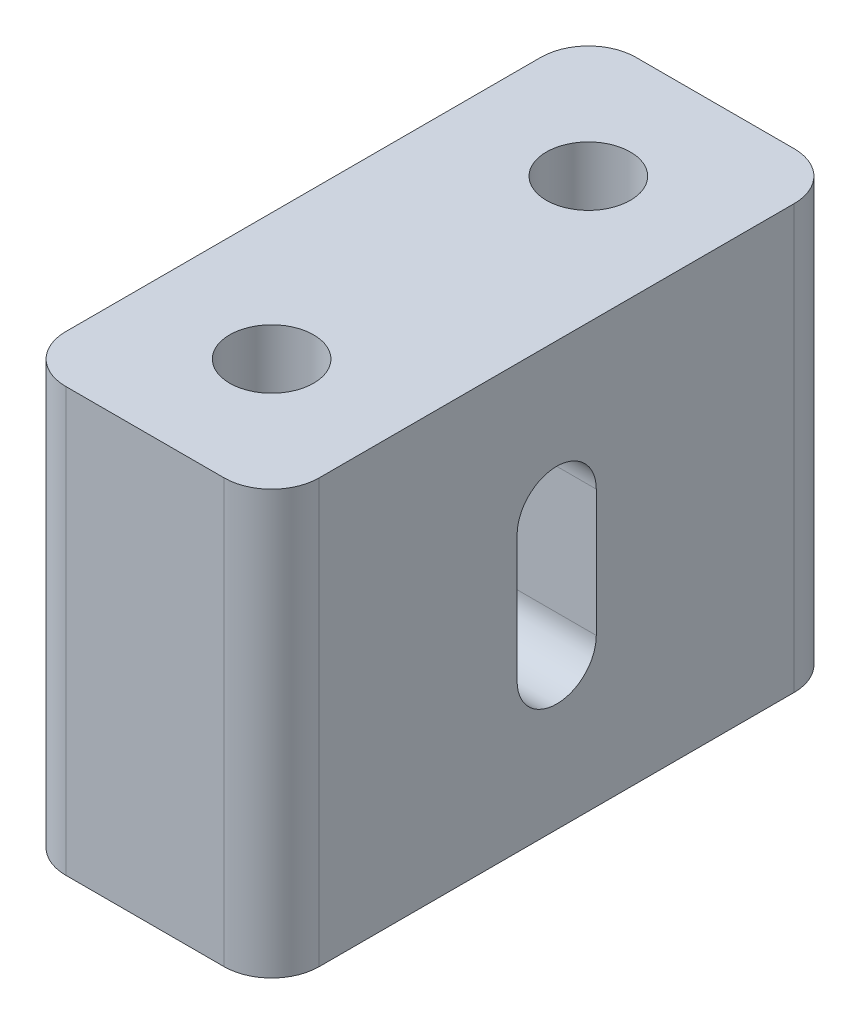
ISO-10303-21;
HEADER;
FILE_DESCRIPTION(('STEP AP214'),'2;1');
FILE_NAME('part.step','',(''),(''),'','','');
FILE_SCHEMA(('AUTOMOTIVE_DESIGN { 1 0 10303 214 1 1 1 1 }'));
ENDSEC;
DATA;
#1=APPLICATION_CONTEXT('core data for automotive mechanical design processes');
#2=APPLICATION_PROTOCOL_DEFINITION('international standard','automotive_design',2000,#1);
#3=PRODUCT_CONTEXT('',#1,'mechanical');
#4=PRODUCT('Part','Part','',(#3));
#5=PRODUCT_RELATED_PRODUCT_CATEGORY('part','',(#4));
#6=PRODUCT_DEFINITION_FORMATION('','',#4);
#7=PRODUCT_DEFINITION_CONTEXT('part definition',#1,'design');
#8=PRODUCT_DEFINITION('design','',#6,#7);
#9=PRODUCT_DEFINITION_SHAPE('','',#8);
#10=(LENGTH_UNIT() NAMED_UNIT(*) SI_UNIT(.MILLI.,.METRE.));
#11=(NAMED_UNIT(*) PLANE_ANGLE_UNIT() SI_UNIT($,.RADIAN.));
#12=(NAMED_UNIT(*) SI_UNIT($,.STERADIAN.) SOLID_ANGLE_UNIT());
#13=UNCERTAINTY_MEASURE_WITH_UNIT(LENGTH_MEASURE(1.E-05),#10,'distance_accuracy_value','');
#14=(GEOMETRIC_REPRESENTATION_CONTEXT(3) GLOBAL_UNCERTAINTY_ASSIGNED_CONTEXT((#13)) GLOBAL_UNIT_ASSIGNED_CONTEXT((#10,
#11,#12)) REPRESENTATION_CONTEXT('',''));
#15=CARTESIAN_POINT('',(0.,0.,0.));
#16=DIRECTION('',(0.,0.,1.));
#17=DIRECTION('',(1.,0.,0.));
#18=AXIS2_PLACEMENT_3D('',#15,#16,#17);
#19=CARTESIAN_POINT('',(-8.,13.3661977236758,18.));
#20=DIRECTION('',(-1.,0.,0.));
#21=DIRECTION('',(0.,0.,1.));
#22=AXIS2_PLACEMENT_3D('',#19,#20,#21);
#23=PLANE('',#22);
#24=CARTESIAN_POINT('',(-8.,-4.,0.));
#25=DIRECTION('',(1.,0.,0.));
#26=DIRECTION('',(0.,0.,-1.));
#27=AXIS2_PLACEMENT_3D('',#24,#25,#26);
#28=CIRCLE('',#27,2.5);
#29=CARTESIAN_POINT('',(-8.,-4.,2.5));
#30=VERTEX_POINT('',#29);
#31=CARTESIAN_POINT('',(-8.,-4.,-2.5));
#32=VERTEX_POINT('',#31);
#33=EDGE_CURVE('E141',#30,#32,#28,.T.);
#34=ORIENTED_EDGE('',*,*,#33,.T.);
#35=DIRECTION('',(0.,1.,0.));
#36=VECTOR('',#35,1.);
#37=CARTESIAN_POINT('',(-8.,-4.,-2.5));
#38=LINE('',#37,#36);
#39=CARTESIAN_POINT('',(-8.,4.,-2.5));
#40=VERTEX_POINT('',#39);
#41=EDGE_CURVE('E147',#32,#40,#38,.T.);
#42=ORIENTED_EDGE('',*,*,#41,.T.);
#43=CARTESIAN_POINT('',(-8.,4.,0.));
#44=DIRECTION('',(1.,0.,0.));
#45=DIRECTION('',(0.,0.,-1.));
#46=AXIS2_PLACEMENT_3D('',#43,#44,#45);
#47=CIRCLE('',#46,2.5);
#48=CARTESIAN_POINT('',(-8.,4.,2.5));
#49=VERTEX_POINT('',#48);
#50=EDGE_CURVE('E47',#40,#49,#47,.T.);
#51=ORIENTED_EDGE('',*,*,#50,.T.);
#52=DIRECTION('',(0.,-1.,0.));
#53=VECTOR('',#52,1.);
#54=CARTESIAN_POINT('',(-8.,-4.,2.5));
#55=LINE('',#54,#53);
#56=EDGE_CURVE('E150',#49,#30,#55,.T.);
#57=ORIENTED_EDGE('',*,*,#56,.T.);
#58=EDGE_LOOP('',(#34,#42,#51,#57));
#59=FACE_BOUND('',#58,.T.);
#60=DIRECTION('',(0.,0.,-1.));
#61=VECTOR('',#60,1.);
#62=CARTESIAN_POINT('',(-8.,13.3661977236758,18.));
#63=LINE('',#62,#61);
#64=CARTESIAN_POINT('',(-8.,13.3661977236758,15.));
#65=VERTEX_POINT('',#64);
#66=CARTESIAN_POINT('',(-8.,13.3661977236758,-15.));
#67=VERTEX_POINT('',#66);
#68=EDGE_CURVE('E170',#65,#67,#63,.T.);
#69=ORIENTED_EDGE('',*,*,#68,.T.);
#70=DIRECTION('',(0.,-1.,0.));
#71=VECTOR('',#70,1.);
#72=CARTESIAN_POINT('',(-8.,13.3661977236758,-15.));
#73=LINE('',#72,#71);
#74=CARTESIAN_POINT('',(-8.,-13.3661977236758,-15.));
#75=VERTEX_POINT('',#74);
#76=EDGE_CURVE('E195',#67,#75,#73,.T.);
#77=ORIENTED_EDGE('',*,*,#76,.T.);
#78=DIRECTION('',(0.,0.,-1.));
#79=VECTOR('',#78,1.);
#80=CARTESIAN_POINT('',(-8.,-13.3661977236758,18.));
#81=LINE('',#80,#79);
#82=CARTESIAN_POINT('',(-8.,-13.3661977236758,15.));
#83=VERTEX_POINT('',#82);
#84=EDGE_CURVE('E169',#83,#75,#81,.T.);
#85=ORIENTED_EDGE('',*,*,#84,.F.);
#86=DIRECTION('',(0.,-1.,0.));
#87=VECTOR('',#86,1.);
#88=CARTESIAN_POINT('',(-8.,13.3661977236758,15.));
#89=LINE('',#88,#87);
#90=EDGE_CURVE('E183',#83,#65,#89,.F.);
#91=ORIENTED_EDGE('',*,*,#90,.T.);
#92=EDGE_LOOP('',(#69,#77,#85,#91));
#93=FACE_BOUND('',#92,.T.);
#94=ADVANCED_FACE('F32',(#59,#93),#23,.T.);
#95=CARTESIAN_POINT('',(-8.,13.3661977236758,18.));
#96=DIRECTION('',(0.,0.,-1.));
#97=DIRECTION('',(-1.,0.,0.));
#98=AXIS2_PLACEMENT_3D('',#95,#96,#97);
#99=PLANE('',#98);
#100=DIRECTION('',(1.,0.,0.));
#101=VECTOR('',#100,1.);
#102=CARTESIAN_POINT('',(-8.,13.3661977236758,18.));
#103=LINE('',#102,#101);
#104=CARTESIAN_POINT('',(-5.,13.3661977236758,18.));
#105=VERTEX_POINT('',#104);
#106=CARTESIAN_POINT('',(5.,13.3661977236758,18.));
#107=VERTEX_POINT('',#106);
#108=EDGE_CURVE('E180',#105,#107,#103,.T.);
#109=ORIENTED_EDGE('',*,*,#108,.F.);
#110=DIRECTION('',(0.,-1.,0.));
#111=VECTOR('',#110,1.);
#112=CARTESIAN_POINT('',(-5.,-13.3661977236758,18.));
#113=LINE('',#112,#111);
#114=CARTESIAN_POINT('',(-5.,-13.3661977236758,18.));
#115=VERTEX_POINT('',#114);
#116=EDGE_CURVE('E11',#105,#115,#113,.T.);
#117=ORIENTED_EDGE('',*,*,#116,.T.);
#118=DIRECTION('',(1.,0.,0.));
#119=VECTOR('',#118,1.);
#120=CARTESIAN_POINT('',(-8.,-13.3661977236758,18.));
#121=LINE('',#120,#119);
#122=CARTESIAN_POINT('',(5.,-13.3661977236758,18.));
#123=VERTEX_POINT('',#122);
#124=EDGE_CURVE('E174',#115,#123,#121,.T.);
#125=ORIENTED_EDGE('',*,*,#124,.T.);
#126=DIRECTION('',(0.,-1.,0.));
#127=VECTOR('',#126,1.);
#128=CARTESIAN_POINT('',(5.,13.3661977236758,18.));
#129=LINE('',#128,#127);
#130=EDGE_CURVE('E40',#123,#107,#129,.F.);
#131=ORIENTED_EDGE('',*,*,#130,.T.);
#132=EDGE_LOOP('',(#109,#117,#125,#131));
#133=FACE_BOUND('',#132,.T.);
#134=ADVANCED_FACE('F226',(#133),#99,.F.);
#135=CARTESIAN_POINT('',(8.,13.3661977236758,18.));
#136=DIRECTION('',(-1.,0.,0.));
#137=DIRECTION('',(0.,0.,1.));
#138=AXIS2_PLACEMENT_3D('',#135,#136,#137);
#139=PLANE('',#138);
#140=DIRECTION('',(0.,1.,0.));
#141=VECTOR('',#140,1.);
#142=CARTESIAN_POINT('',(8.,-4.,-2.5));
#143=LINE('',#142,#141);
#144=CARTESIAN_POINT('',(8.,-4.,-2.5));
#145=VERTEX_POINT('',#144);
#146=CARTESIAN_POINT('',(8.,4.,-2.5));
#147=VERTEX_POINT('',#146);
#148=EDGE_CURVE('E132',#145,#147,#143,.T.);
#149=ORIENTED_EDGE('',*,*,#148,.F.);
#150=CARTESIAN_POINT('',(8.,-4.,0.));
#151=DIRECTION('',(1.,0.,0.));
#152=DIRECTION('',(0.,0.,-1.));
#153=AXIS2_PLACEMENT_3D('',#150,#151,#152);
#154=CIRCLE('',#153,2.5);
#155=CARTESIAN_POINT('',(8.,-4.,2.5));
#156=VERTEX_POINT('',#155);
#157=EDGE_CURVE('E55',#156,#145,#154,.T.);
#158=ORIENTED_EDGE('',*,*,#157,.F.);
#159=DIRECTION('',(0.,-1.,0.));
#160=VECTOR('',#159,1.);
#161=CARTESIAN_POINT('',(8.,-4.,2.5));
#162=LINE('',#161,#160);
#163=CARTESIAN_POINT('',(8.,4.,2.5));
#164=VERTEX_POINT('',#163);
#165=EDGE_CURVE('E139',#164,#156,#162,.T.);
#166=ORIENTED_EDGE('',*,*,#165,.F.);
#167=CARTESIAN_POINT('',(8.,4.,0.));
#168=DIRECTION('',(1.,0.,0.));
#169=DIRECTION('',(0.,0.,-1.));
#170=AXIS2_PLACEMENT_3D('',#167,#168,#169);
#171=CIRCLE('',#170,2.5);
#172=EDGE_CURVE('E123',#147,#164,#171,.T.);
#173=ORIENTED_EDGE('',*,*,#172,.F.);
#174=EDGE_LOOP('',(#149,#158,#166,#173));
#175=FACE_BOUND('',#174,.T.);
#176=DIRECTION('',(0.,0.,-1.));
#177=VECTOR('',#176,1.);
#178=CARTESIAN_POINT('',(8.,-13.3661977236758,18.));
#179=LINE('',#178,#177);
#180=CARTESIAN_POINT('',(8.,-13.3661977236758,15.));
#181=VERTEX_POINT('',#180);
#182=CARTESIAN_POINT('',(8.,-13.3661977236758,-15.));
#183=VERTEX_POINT('',#182);
#184=EDGE_CURVE('E189',#181,#183,#179,.T.);
#185=ORIENTED_EDGE('',*,*,#184,.T.);
#186=DIRECTION('',(0.,-1.,0.));
#187=VECTOR('',#186,1.);
#188=CARTESIAN_POINT('',(8.,13.3661977236758,-15.));
#189=LINE('',#188,#187);
#190=CARTESIAN_POINT('',(8.,13.3661977236758,-15.));
#191=VERTEX_POINT('',#190);
#192=EDGE_CURVE('E222',#183,#191,#189,.F.);
#193=ORIENTED_EDGE('',*,*,#192,.T.);
#194=DIRECTION('',(0.,0.,-1.));
#195=VECTOR('',#194,1.);
#196=CARTESIAN_POINT('',(8.,13.3661977236758,18.));
#197=LINE('',#196,#195);
#198=CARTESIAN_POINT('',(8.,13.3661977236758,15.));
#199=VERTEX_POINT('',#198);
#200=EDGE_CURVE('E177',#199,#191,#197,.T.);
#201=ORIENTED_EDGE('',*,*,#200,.F.);
#202=DIRECTION('',(0.,-1.,0.));
#203=VECTOR('',#202,1.);
#204=CARTESIAN_POINT('',(8.,13.3661977236758,15.));
#205=LINE('',#204,#203);
#206=EDGE_CURVE('E219',#199,#181,#205,.T.);
#207=ORIENTED_EDGE('',*,*,#206,.T.);
#208=EDGE_LOOP('',(#185,#193,#201,#207));
#209=FACE_BOUND('',#208,.T.);
#210=ADVANCED_FACE('F136',(#175,#209),#139,.F.);
#211=CARTESIAN_POINT('',(-8.,13.3661977236758,-18.));
#212=DIRECTION('',(0.,0.,-1.));
#213=DIRECTION('',(-1.,0.,0.));
#214=AXIS2_PLACEMENT_3D('',#211,#212,#213);
#215=PLANE('',#214);
#216=DIRECTION('',(1.,0.,0.));
#217=VECTOR('',#216,1.);
#218=CARTESIAN_POINT('',(-8.,-13.3661977236758,-18.));
#219=LINE('',#218,#217);
#220=CARTESIAN_POINT('',(-5.,-13.3661977236758,-18.));
#221=VERTEX_POINT('',#220);
#222=CARTESIAN_POINT('',(5.,-13.3661977236758,-18.));
#223=VERTEX_POINT('',#222);
#224=EDGE_CURVE('E186',#221,#223,#219,.T.);
#225=ORIENTED_EDGE('',*,*,#224,.F.);
#226=DIRECTION('',(0.,-1.,0.));
#227=VECTOR('',#226,1.);
#228=CARTESIAN_POINT('',(-5.,13.3661977236758,-18.));
#229=LINE('',#228,#227);
#230=CARTESIAN_POINT('',(-5.,13.3661977236758,-18.));
#231=VERTEX_POINT('',#230);
#232=EDGE_CURVE('E209',#221,#231,#229,.F.);
#233=ORIENTED_EDGE('',*,*,#232,.T.);
#234=DIRECTION('',(1.,0.,0.));
#235=VECTOR('',#234,1.);
#236=CARTESIAN_POINT('',(-8.,13.3661977236758,-18.));
#237=LINE('',#236,#235);
#238=CARTESIAN_POINT('',(5.,13.3661977236758,-18.));
#239=VERTEX_POINT('',#238);
#240=EDGE_CURVE('E173',#231,#239,#237,.T.);
#241=ORIENTED_EDGE('',*,*,#240,.T.);
#242=DIRECTION('',(0.,-1.,0.));
#243=VECTOR('',#242,1.);
#244=CARTESIAN_POINT('',(5.,-13.3661977236758,-18.));
#245=LINE('',#244,#243);
#246=EDGE_CURVE('E206',#239,#223,#245,.T.);
#247=ORIENTED_EDGE('',*,*,#246,.T.);
#248=EDGE_LOOP('',(#225,#233,#241,#247));
#249=FACE_BOUND('',#248,.T.);
#250=ADVANCED_FACE('F248',(#249),#215,.T.);
#251=CARTESIAN_POINT('',(0.,13.3661977236758,0.));
#252=DIRECTION('',(0.,-1.,0.));
#253=DIRECTION('',(0.,0.,-1.));
#254=AXIS2_PLACEMENT_3D('',#251,#252,#253);
#255=PLANE('',#254);
#256=CARTESIAN_POINT('',(0.,13.3661977236758,-10.));
#257=DIRECTION('',(0.,1.,0.));
#258=DIRECTION('',(0.,0.,1.));
#259=AXIS2_PLACEMENT_3D('',#256,#257,#258);
#260=CIRCLE('',#259,2.64999999999999);
#261=CARTESIAN_POINT('',(0.,13.3661977236758,-7.35000000000001));
#262=VERTEX_POINT('',#261);
#263=EDGE_CURVE('E155',#262,#262,#260,.T.);
#264=ORIENTED_EDGE('',*,*,#263,.F.);
#265=EDGE_LOOP('',(#264));
#266=FACE_BOUND('',#265,.T.);
#267=CARTESIAN_POINT('',(0.,13.3661977236758,10.));
#268=DIRECTION('',(0.,1.,0.));
#269=DIRECTION('',(0.,0.,1.));
#270=AXIS2_PLACEMENT_3D('',#267,#268,#269);
#271=CIRCLE('',#270,2.64999999999999);
#272=CARTESIAN_POINT('',(0.,13.3661977236758,12.65));
#273=VERTEX_POINT('',#272);
#274=EDGE_CURVE('E163',#273,#273,#271,.T.);
#275=ORIENTED_EDGE('',*,*,#274,.F.);
#276=EDGE_LOOP('',(#275));
#277=FACE_BOUND('',#276,.T.);
#278=ORIENTED_EDGE('',*,*,#240,.F.);
#279=CARTESIAN_POINT('',(-5.,13.3661977236758,-15.));
#280=DIRECTION('',(0.,-1.,0.));
#281=DIRECTION('',(0.,0.,-1.));
#282=AXIS2_PLACEMENT_3D('',#279,#280,#281);
#283=CIRCLE('',#282,3.);
#284=EDGE_CURVE('E217',#231,#67,#283,.F.);
#285=ORIENTED_EDGE('',*,*,#284,.T.);
#286=ORIENTED_EDGE('',*,*,#68,.F.);
#287=CARTESIAN_POINT('',(-5.,13.3661977236758,15.));
#288=DIRECTION('',(0.,-1.,0.));
#289=DIRECTION('',(0.,0.,-1.));
#290=AXIS2_PLACEMENT_3D('',#287,#288,#289);
#291=CIRCLE('',#290,3.);
#292=EDGE_CURVE('E213',#65,#105,#291,.F.);
#293=ORIENTED_EDGE('',*,*,#292,.T.);
#294=ORIENTED_EDGE('',*,*,#108,.T.);
#295=CARTESIAN_POINT('',(5.,13.3661977236758,15.));
#296=DIRECTION('',(0.,-1.,0.));
#297=DIRECTION('',(0.,0.,-1.));
#298=AXIS2_PLACEMENT_3D('',#295,#296,#297);
#299=CIRCLE('',#298,3.);
#300=EDGE_CURVE('E211',#107,#199,#299,.F.);
#301=ORIENTED_EDGE('',*,*,#300,.T.);
#302=ORIENTED_EDGE('',*,*,#200,.T.);
#303=CARTESIAN_POINT('',(5.,13.3661977236758,-15.));
#304=DIRECTION('',(0.,-1.,0.));
#305=DIRECTION('',(0.,0.,-1.));
#306=AXIS2_PLACEMENT_3D('',#303,#304,#305);
#307=CIRCLE('',#306,3.);
#308=EDGE_CURVE('E215',#191,#239,#307,.F.);
#309=ORIENTED_EDGE('',*,*,#308,.T.);
#310=EDGE_LOOP('',(#278,#285,#286,#293,#294,#301,#302,#309));
#311=FACE_BOUND('',#310,.T.);
#312=ADVANCED_FACE('F233',(#266,#277,#311),#255,.F.);
#313=CARTESIAN_POINT('',(0.,-13.3661977236758,0.));
#314=DIRECTION('',(0.,-1.,0.));
#315=DIRECTION('',(0.,0.,-1.));
#316=AXIS2_PLACEMENT_3D('',#313,#314,#315);
#317=PLANE('',#316);
#318=CARTESIAN_POINT('',(0.,-13.3661977236758,-10.));
#319=DIRECTION('',(0.,1.,0.));
#320=DIRECTION('',(0.,0.,1.));
#321=AXIS2_PLACEMENT_3D('',#318,#319,#320);
#322=CIRCLE('',#321,2.65);
#323=CARTESIAN_POINT('',(0.,-13.3661977236758,-7.35));
#324=VERTEX_POINT('',#323);
#325=EDGE_CURVE('E160',#324,#324,#322,.T.);
#326=ORIENTED_EDGE('',*,*,#325,.T.);
#327=EDGE_LOOP('',(#326));
#328=FACE_BOUND('',#327,.T.);
#329=CARTESIAN_POINT('',(0.,-13.3661977236758,10.));
#330=DIRECTION('',(0.,1.,0.));
#331=DIRECTION('',(0.,0.,1.));
#332=AXIS2_PLACEMENT_3D('',#329,#330,#331);
#333=CIRCLE('',#332,2.65);
#334=CARTESIAN_POINT('',(0.,-13.3661977236758,12.65));
#335=VERTEX_POINT('',#334);
#336=EDGE_CURVE('E166',#335,#335,#333,.T.);
#337=ORIENTED_EDGE('',*,*,#336,.T.);
#338=EDGE_LOOP('',(#337));
#339=FACE_BOUND('',#338,.T.);
#340=ORIENTED_EDGE('',*,*,#84,.T.);
#341=CARTESIAN_POINT('',(-5.,-13.3661977236758,-15.));
#342=DIRECTION('',(0.,-1.,0.));
#343=DIRECTION('',(0.,0.,-1.));
#344=AXIS2_PLACEMENT_3D('',#341,#342,#343);
#345=CIRCLE('',#344,3.);
#346=EDGE_CURVE('E204',#75,#221,#345,.T.);
#347=ORIENTED_EDGE('',*,*,#346,.T.);
#348=ORIENTED_EDGE('',*,*,#224,.T.);
#349=CARTESIAN_POINT('',(5.,-13.3661977236758,-15.));
#350=DIRECTION('',(0.,-1.,0.));
#351=DIRECTION('',(0.,0.,-1.));
#352=AXIS2_PLACEMENT_3D('',#349,#350,#351);
#353=CIRCLE('',#352,3.);
#354=EDGE_CURVE('E202',#223,#183,#353,.T.);
#355=ORIENTED_EDGE('',*,*,#354,.T.);
#356=ORIENTED_EDGE('',*,*,#184,.F.);
#357=CARTESIAN_POINT('',(5.,-13.3661977236758,15.));
#358=DIRECTION('',(0.,-1.,0.));
#359=DIRECTION('',(0.,0.,-1.));
#360=AXIS2_PLACEMENT_3D('',#357,#358,#359);
#361=CIRCLE('',#360,3.);
#362=EDGE_CURVE('E198',#181,#123,#361,.T.);
#363=ORIENTED_EDGE('',*,*,#362,.T.);
#364=ORIENTED_EDGE('',*,*,#124,.F.);
#365=CARTESIAN_POINT('',(-5.,-13.3661977236758,15.));
#366=DIRECTION('',(0.,-1.,0.));
#367=DIRECTION('',(0.,0.,-1.));
#368=AXIS2_PLACEMENT_3D('',#365,#366,#367);
#369=CIRCLE('',#368,3.);
#370=EDGE_CURVE('E200',#115,#83,#369,.T.);
#371=ORIENTED_EDGE('',*,*,#370,.T.);
#372=EDGE_LOOP('',(#340,#347,#348,#355,#356,#363,#364,#371));
#373=FACE_BOUND('',#372,.T.);
#374=ADVANCED_FACE('F241',(#328,#339,#373),#317,.T.);
#375=CARTESIAN_POINT('',(0.,13.3661977236758,10.));
#376=DIRECTION('',(0.,1.,0.));
#377=DIRECTION('',(0.,0.,1.));
#378=AXIS2_PLACEMENT_3D('',#375,#376,#377);
#379=CYLINDRICAL_SURFACE('',#378,2.64999999999999);
#380=ORIENTED_EDGE('',*,*,#336,.F.);
#381=EDGE_LOOP('',(#380));
#382=FACE_BOUND('',#381,.T.);
#383=ORIENTED_EDGE('',*,*,#274,.T.);
#384=EDGE_LOOP('',(#383));
#385=FACE_BOUND('',#384,.T.);
#386=ADVANCED_FACE('F281',(#382,#385),#379,.F.);
#387=CARTESIAN_POINT('',(0.,13.3661977236758,-10.));
#388=DIRECTION('',(0.,1.,0.));
#389=DIRECTION('',(0.,0.,1.));
#390=AXIS2_PLACEMENT_3D('',#387,#388,#389);
#391=CYLINDRICAL_SURFACE('',#390,2.64999999999999);
#392=ORIENTED_EDGE('',*,*,#325,.F.);
#393=EDGE_LOOP('',(#392));
#394=FACE_BOUND('',#393,.T.);
#395=ORIENTED_EDGE('',*,*,#263,.T.);
#396=EDGE_LOOP('',(#395));
#397=FACE_BOUND('',#396,.T.);
#398=ADVANCED_FACE('F277',(#394,#397),#391,.F.);
#399=CARTESIAN_POINT('',(-5.,13.3661977236758,-15.));
#400=DIRECTION('',(0.,-1.,0.));
#401=DIRECTION('',(0.,0.,-1.));
#402=AXIS2_PLACEMENT_3D('',#399,#400,#401);
#403=CYLINDRICAL_SURFACE('',#402,3.);
#404=ORIENTED_EDGE('',*,*,#284,.F.);
#405=ORIENTED_EDGE('',*,*,#232,.F.);
#406=ORIENTED_EDGE('',*,*,#346,.F.);
#407=ORIENTED_EDGE('',*,*,#76,.F.);
#408=EDGE_LOOP('',(#404,#405,#406,#407));
#409=FACE_BOUND('',#408,.T.);
#410=ADVANCED_FACE('F253',(#409),#403,.T.);
#411=CARTESIAN_POINT('',(5.,13.3661977236758,-15.));
#412=DIRECTION('',(0.,1.,0.));
#413=DIRECTION('',(0.,0.,1.));
#414=AXIS2_PLACEMENT_3D('',#411,#412,#413);
#415=CYLINDRICAL_SURFACE('',#414,3.);
#416=ORIENTED_EDGE('',*,*,#308,.F.);
#417=ORIENTED_EDGE('',*,*,#192,.F.);
#418=ORIENTED_EDGE('',*,*,#354,.F.);
#419=ORIENTED_EDGE('',*,*,#246,.F.);
#420=EDGE_LOOP('',(#416,#417,#418,#419));
#421=FACE_BOUND('',#420,.T.);
#422=ADVANCED_FACE('F246',(#421),#415,.T.);
#423=CARTESIAN_POINT('',(-5.,13.3661977236758,15.));
#424=DIRECTION('',(0.,1.,0.));
#425=DIRECTION('',(0.,0.,1.));
#426=AXIS2_PLACEMENT_3D('',#423,#424,#425);
#427=CYLINDRICAL_SURFACE('',#426,3.);
#428=ORIENTED_EDGE('',*,*,#292,.F.);
#429=ORIENTED_EDGE('',*,*,#90,.F.);
#430=ORIENTED_EDGE('',*,*,#370,.F.);
#431=ORIENTED_EDGE('',*,*,#116,.F.);
#432=EDGE_LOOP('',(#428,#429,#430,#431));
#433=FACE_BOUND('',#432,.T.);
#434=ADVANCED_FACE('F258',(#433),#427,.T.);
#435=CARTESIAN_POINT('',(5.,13.3661977236758,15.));
#436=DIRECTION('',(0.,-1.,0.));
#437=DIRECTION('',(0.,0.,-1.));
#438=AXIS2_PLACEMENT_3D('',#435,#436,#437);
#439=CYLINDRICAL_SURFACE('',#438,3.);
#440=ORIENTED_EDGE('',*,*,#300,.F.);
#441=ORIENTED_EDGE('',*,*,#130,.F.);
#442=ORIENTED_EDGE('',*,*,#362,.F.);
#443=ORIENTED_EDGE('',*,*,#206,.F.);
#444=EDGE_LOOP('',(#440,#441,#442,#443));
#445=FACE_BOUND('',#444,.T.);
#446=ADVANCED_FACE('F34',(#445),#439,.T.);
#447=CARTESIAN_POINT('',(-8.,-4.,0.));
#448=DIRECTION('',(1.,0.,0.));
#449=DIRECTION('',(0.,0.,-1.));
#450=AXIS2_PLACEMENT_3D('',#447,#448,#449);
#451=CYLINDRICAL_SURFACE('',#450,2.5);
#452=DIRECTION('',(1.,0.,0.));
#453=VECTOR('',#452,1.);
#454=CARTESIAN_POINT('',(-8.,-4.,-2.5));
#455=LINE('',#454,#453);
#456=EDGE_CURVE('E129',#32,#145,#455,.T.);
#457=ORIENTED_EDGE('',*,*,#456,.F.);
#458=ORIENTED_EDGE('',*,*,#33,.F.);
#459=DIRECTION('',(1.,0.,0.));
#460=VECTOR('',#459,1.);
#461=CARTESIAN_POINT('',(-8.,-4.,2.5));
#462=LINE('',#461,#460);
#463=EDGE_CURVE('E153',#30,#156,#462,.T.);
#464=ORIENTED_EDGE('',*,*,#463,.T.);
#465=ORIENTED_EDGE('',*,*,#157,.T.);
#466=EDGE_LOOP('',(#457,#458,#464,#465));
#467=FACE_BOUND('',#466,.T.);
#468=ADVANCED_FACE('F264',(#467),#451,.F.);
#469=CARTESIAN_POINT('',(-8.,-4.,2.5));
#470=DIRECTION('',(0.,0.,1.));
#471=DIRECTION('',(0.,-1.,0.));
#472=AXIS2_PLACEMENT_3D('',#469,#470,#471);
#473=PLANE('',#472);
#474=ORIENTED_EDGE('',*,*,#463,.F.);
#475=ORIENTED_EDGE('',*,*,#56,.F.);
#476=DIRECTION('',(1.,0.,0.));
#477=VECTOR('',#476,1.);
#478=CARTESIAN_POINT('',(-8.,4.,2.5));
#479=LINE('',#478,#477);
#480=EDGE_CURVE('E128',#49,#164,#479,.T.);
#481=ORIENTED_EDGE('',*,*,#480,.T.);
#482=ORIENTED_EDGE('',*,*,#165,.T.);
#483=EDGE_LOOP('',(#474,#475,#481,#482));
#484=FACE_BOUND('',#483,.T.);
#485=ADVANCED_FACE('F352',(#484),#473,.F.);
#486=CARTESIAN_POINT('',(-8.,4.,0.));
#487=DIRECTION('',(1.,0.,0.));
#488=DIRECTION('',(0.,0.,-1.));
#489=AXIS2_PLACEMENT_3D('',#486,#487,#488);
#490=CYLINDRICAL_SURFACE('',#489,2.5);
#491=ORIENTED_EDGE('',*,*,#480,.F.);
#492=ORIENTED_EDGE('',*,*,#50,.F.);
#493=DIRECTION('',(1.,0.,0.));
#494=VECTOR('',#493,1.);
#495=CARTESIAN_POINT('',(-8.,4.,-2.5));
#496=LINE('',#495,#494);
#497=EDGE_CURVE('E119',#40,#147,#496,.T.);
#498=ORIENTED_EDGE('',*,*,#497,.T.);
#499=ORIENTED_EDGE('',*,*,#172,.T.);
#500=EDGE_LOOP('',(#491,#492,#498,#499));
#501=FACE_BOUND('',#500,.T.);
#502=ADVANCED_FACE('F121',(#501),#490,.F.);
#503=CARTESIAN_POINT('',(-8.,-4.,-2.5));
#504=DIRECTION('',(0.,0.,-1.));
#505=DIRECTION('',(0.,1.,0.));
#506=AXIS2_PLACEMENT_3D('',#503,#504,#505);
#507=PLANE('',#506);
#508=ORIENTED_EDGE('',*,*,#497,.F.);
#509=ORIENTED_EDGE('',*,*,#41,.F.);
#510=ORIENTED_EDGE('',*,*,#456,.T.);
#511=ORIENTED_EDGE('',*,*,#148,.T.);
#512=EDGE_LOOP('',(#508,#509,#510,#511));
#513=FACE_BOUND('',#512,.T.);
#514=ADVANCED_FACE('F133',(#513),#507,.F.);
#515=CLOSED_SHELL('',(#94,#134,#210,#250,#312,#374,#386,#398,#410,#422,#434,#446,#468,#485,#502,#514));
#516=MANIFOLD_SOLID_BREP('B2',#515);
#517=ADVANCED_BREP_SHAPE_REPRESENTATION('',(#18,#516),#14);
#518=SHAPE_DEFINITION_REPRESENTATION(#9,#517);
ENDSEC;
END-ISO-10303-21;
